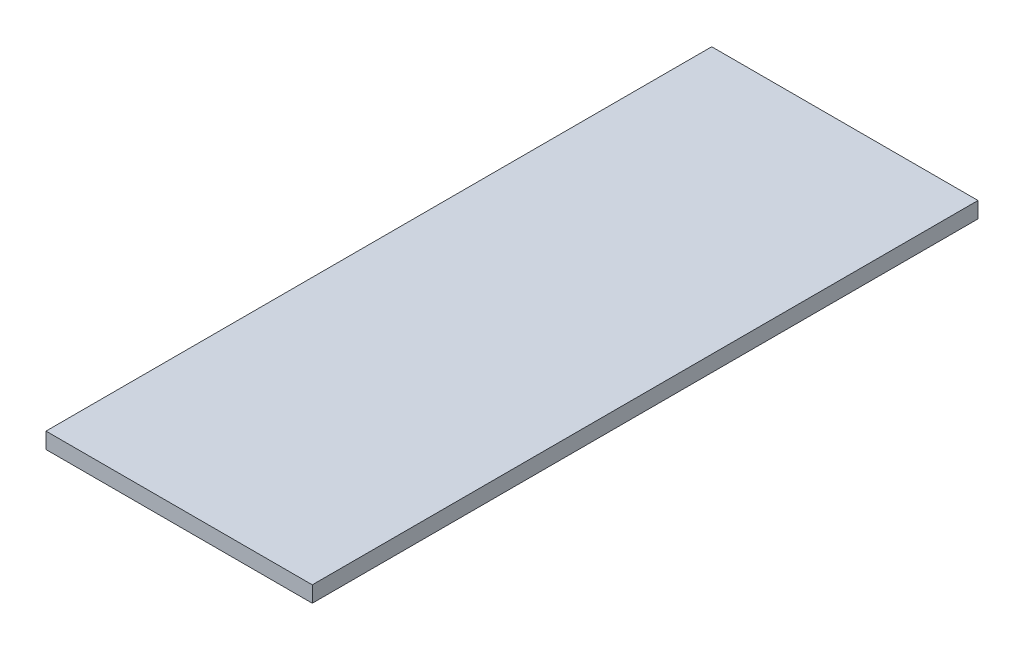
ISO-10303-21;
HEADER;
FILE_DESCRIPTION(('STEP AP214'),'2;1');
FILE_NAME('part.step','',(''),(''),'','','');
FILE_SCHEMA(('AUTOMOTIVE_DESIGN { 1 0 10303 214 1 1 1 1 }'));
ENDSEC;
DATA;
#1=APPLICATION_CONTEXT('core data for automotive mechanical design processes');
#2=APPLICATION_PROTOCOL_DEFINITION('international standard','automotive_design',2000,#1);
#3=PRODUCT_CONTEXT('',#1,'mechanical');
#4=PRODUCT('Part','Part','',(#3));
#5=PRODUCT_RELATED_PRODUCT_CATEGORY('part','',(#4));
#6=PRODUCT_DEFINITION_FORMATION('','',#4);
#7=PRODUCT_DEFINITION_CONTEXT('part definition',#1,'design');
#8=PRODUCT_DEFINITION('design','',#6,#7);
#9=PRODUCT_DEFINITION_SHAPE('','',#8);
#10=(LENGTH_UNIT() NAMED_UNIT(*) SI_UNIT(.MILLI.,.METRE.));
#11=(NAMED_UNIT(*) PLANE_ANGLE_UNIT() SI_UNIT($,.RADIAN.));
#12=(NAMED_UNIT(*) SI_UNIT($,.STERADIAN.) SOLID_ANGLE_UNIT());
#13=UNCERTAINTY_MEASURE_WITH_UNIT(LENGTH_MEASURE(1.E-05),#10,'distance_accuracy_value','');
#14=(GEOMETRIC_REPRESENTATION_CONTEXT(3) GLOBAL_UNCERTAINTY_ASSIGNED_CONTEXT((#13)) GLOBAL_UNIT_ASSIGNED_CONTEXT((#10,
#11,#12)) REPRESENTATION_CONTEXT('',''));
#15=CARTESIAN_POINT('',(0.,0.,0.));
#16=DIRECTION('',(0.,0.,1.));
#17=DIRECTION('',(1.,0.,0.));
#18=AXIS2_PLACEMENT_3D('',#15,#16,#17);
#19=CARTESIAN_POINT('',(25.,3.,-62.5));
#20=DIRECTION('',(-1.,0.,0.));
#21=DIRECTION('',(0.,0.,1.));
#22=AXIS2_PLACEMENT_3D('',#19,#20,#21);
#23=PLANE('',#22);
#24=DIRECTION('',(0.,0.,-1.));
#25=VECTOR('',#24,1.);
#26=CARTESIAN_POINT('',(25.,0.,-62.5));
#27=LINE('',#26,#25);
#28=CARTESIAN_POINT('',(25.,0.,62.5));
#29=VERTEX_POINT('',#28);
#30=CARTESIAN_POINT('',(25.,0.,-62.5));
#31=VERTEX_POINT('',#30);
#32=EDGE_CURVE('E98',#29,#31,#27,.T.);
#33=ORIENTED_EDGE('',*,*,#32,.T.);
#34=DIRECTION('',(0.,-1.,0.));
#35=VECTOR('',#34,1.);
#36=CARTESIAN_POINT('',(25.,3.,-62.5));
#37=LINE('',#36,#35);
#38=CARTESIAN_POINT('',(25.,3.,-62.5));
#39=VERTEX_POINT('',#38);
#40=EDGE_CURVE('E11',#39,#31,#37,.T.);
#41=ORIENTED_EDGE('',*,*,#40,.F.);
#42=DIRECTION('',(0.,0.,-1.));
#43=VECTOR('',#42,1.);
#44=CARTESIAN_POINT('',(25.,3.,-62.5));
#45=LINE('',#44,#43);
#46=CARTESIAN_POINT('',(25.,3.,62.5));
#47=VERTEX_POINT('',#46);
#48=EDGE_CURVE('E86',#47,#39,#45,.T.);
#49=ORIENTED_EDGE('',*,*,#48,.F.);
#50=DIRECTION('',(0.,-1.,0.));
#51=VECTOR('',#50,1.);
#52=CARTESIAN_POINT('',(25.,3.,62.5));
#53=LINE('',#52,#51);
#54=EDGE_CURVE('E94',#47,#29,#53,.T.);
#55=ORIENTED_EDGE('',*,*,#54,.T.);
#56=EDGE_LOOP('',(#33,#41,#49,#55));
#57=FACE_BOUND('',#56,.T.);
#58=ADVANCED_FACE('F35',(#57),#23,.F.);
#59=CARTESIAN_POINT('',(-25.,3.,-62.5));
#60=DIRECTION('',(0.,0.,1.));
#61=DIRECTION('',(1.,0.,0.));
#62=AXIS2_PLACEMENT_3D('',#59,#60,#61);
#63=PLANE('',#62);
#64=DIRECTION('',(-1.,0.,0.));
#65=VECTOR('',#64,1.);
#66=CARTESIAN_POINT('',(-25.,0.,-62.5));
#67=LINE('',#66,#65);
#68=CARTESIAN_POINT('',(-25.,0.,-62.5));
#69=VERTEX_POINT('',#68);
#70=EDGE_CURVE('E90',#31,#69,#67,.T.);
#71=ORIENTED_EDGE('',*,*,#70,.T.);
#72=DIRECTION('',(0.,-1.,0.));
#73=VECTOR('',#72,1.);
#74=CARTESIAN_POINT('',(-25.,3.,-62.5));
#75=LINE('',#74,#73);
#76=CARTESIAN_POINT('',(-25.,3.,-62.5));
#77=VERTEX_POINT('',#76);
#78=EDGE_CURVE('E43',#77,#69,#75,.T.);
#79=ORIENTED_EDGE('',*,*,#78,.F.);
#80=DIRECTION('',(-1.,0.,0.));
#81=VECTOR('',#80,1.);
#82=CARTESIAN_POINT('',(-25.,3.,-62.5));
#83=LINE('',#82,#81);
#84=EDGE_CURVE('E81',#39,#77,#83,.T.);
#85=ORIENTED_EDGE('',*,*,#84,.F.);
#86=ORIENTED_EDGE('',*,*,#40,.T.);
#87=EDGE_LOOP('',(#71,#79,#85,#86));
#88=FACE_BOUND('',#87,.T.);
#89=ADVANCED_FACE('F89',(#88),#63,.F.);
#90=CARTESIAN_POINT('',(-25.,3.,-62.5));
#91=DIRECTION('',(1.,0.,0.));
#92=DIRECTION('',(0.,0.,-1.));
#93=AXIS2_PLACEMENT_3D('',#90,#91,#92);
#94=PLANE('',#93);
#95=DIRECTION('',(0.,0.,1.));
#96=VECTOR('',#95,1.);
#97=CARTESIAN_POINT('',(-25.,0.,-62.5));
#98=LINE('',#97,#96);
#99=CARTESIAN_POINT('',(-25.,0.,62.5));
#100=VERTEX_POINT('',#99);
#101=EDGE_CURVE('E68',#69,#100,#98,.T.);
#102=ORIENTED_EDGE('',*,*,#101,.T.);
#103=DIRECTION('',(0.,-1.,0.));
#104=VECTOR('',#103,1.);
#105=CARTESIAN_POINT('',(-25.,3.,62.5));
#106=LINE('',#105,#104);
#107=CARTESIAN_POINT('',(-25.,3.,62.5));
#108=VERTEX_POINT('',#107);
#109=EDGE_CURVE('E91',#108,#100,#106,.T.);
#110=ORIENTED_EDGE('',*,*,#109,.F.);
#111=DIRECTION('',(0.,0.,1.));
#112=VECTOR('',#111,1.);
#113=CARTESIAN_POINT('',(-25.,3.,-62.5));
#114=LINE('',#113,#112);
#115=EDGE_CURVE('E84',#77,#108,#114,.T.);
#116=ORIENTED_EDGE('',*,*,#115,.F.);
#117=ORIENTED_EDGE('',*,*,#78,.T.);
#118=EDGE_LOOP('',(#102,#110,#116,#117));
#119=FACE_BOUND('',#118,.T.);
#120=ADVANCED_FACE('F92',(#119),#94,.F.);
#121=CARTESIAN_POINT('',(-25.,3.,62.5));
#122=DIRECTION('',(0.,0.,-1.));
#123=DIRECTION('',(-1.,0.,0.));
#124=AXIS2_PLACEMENT_3D('',#121,#122,#123);
#125=PLANE('',#124);
#126=DIRECTION('',(1.,0.,0.));
#127=VECTOR('',#126,1.);
#128=CARTESIAN_POINT('',(-25.,0.,62.5));
#129=LINE('',#128,#127);
#130=EDGE_CURVE('E74',#100,#29,#129,.T.);
#131=ORIENTED_EDGE('',*,*,#130,.T.);
#132=ORIENTED_EDGE('',*,*,#54,.F.);
#133=DIRECTION('',(1.,0.,0.));
#134=VECTOR('',#133,1.);
#135=CARTESIAN_POINT('',(-25.,3.,62.5));
#136=LINE('',#135,#134);
#137=EDGE_CURVE('E51',#108,#47,#136,.T.);
#138=ORIENTED_EDGE('',*,*,#137,.F.);
#139=ORIENTED_EDGE('',*,*,#109,.T.);
#140=EDGE_LOOP('',(#131,#132,#138,#139));
#141=FACE_BOUND('',#140,.T.);
#142=ADVANCED_FACE('F105',(#141),#125,.F.);
#143=CARTESIAN_POINT('',(0.,3.,0.));
#144=DIRECTION('',(0.,1.,0.));
#145=DIRECTION('',(0.,0.,1.));
#146=AXIS2_PLACEMENT_3D('',#143,#144,#145);
#147=PLANE('',#146);
#148=ORIENTED_EDGE('',*,*,#48,.T.);
#149=ORIENTED_EDGE('',*,*,#84,.T.);
#150=ORIENTED_EDGE('',*,*,#115,.T.);
#151=ORIENTED_EDGE('',*,*,#137,.T.);
#152=EDGE_LOOP('',(#148,#149,#150,#151));
#153=FACE_BOUND('',#152,.T.);
#154=ADVANCED_FACE('F82',(#153),#147,.T.);
#155=CARTESIAN_POINT('',(0.,0.,0.));
#156=DIRECTION('',(0.,1.,0.));
#157=DIRECTION('',(0.,0.,1.));
#158=AXIS2_PLACEMENT_3D('',#155,#156,#157);
#159=PLANE('',#158);
#160=ORIENTED_EDGE('',*,*,#32,.F.);
#161=ORIENTED_EDGE('',*,*,#130,.F.);
#162=ORIENTED_EDGE('',*,*,#101,.F.);
#163=ORIENTED_EDGE('',*,*,#70,.F.);
#164=EDGE_LOOP('',(#160,#161,#162,#163));
#165=FACE_BOUND('',#164,.T.);
#166=ADVANCED_FACE('F108',(#165),#159,.F.);
#167=CLOSED_SHELL('',(#58,#89,#120,#142,#154,#166));
#168=MANIFOLD_SOLID_BREP('B2',#167);
#169=ADVANCED_BREP_SHAPE_REPRESENTATION('',(#18,#168),#14);
#170=SHAPE_DEFINITION_REPRESENTATION(#9,#169);
ENDSEC;
END-ISO-10303-21;
